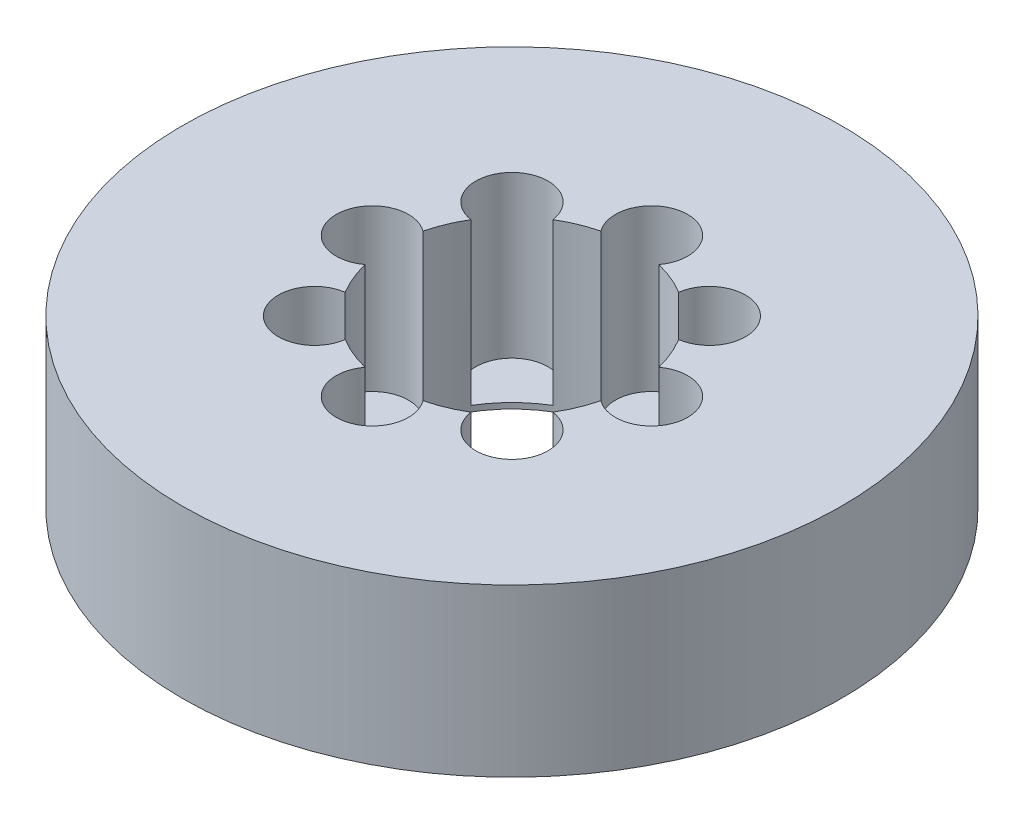
ISO-10303-21;
HEADER;
FILE_DESCRIPTION(('STEP AP214'),'2;1');
FILE_NAME('part.step','',(''),(''),'','','');
FILE_SCHEMA(('AUTOMOTIVE_DESIGN { 1 0 10303 214 1 1 1 1 }'));
ENDSEC;
DATA;
#1=APPLICATION_CONTEXT('core data for automotive mechanical design processes');
#2=APPLICATION_PROTOCOL_DEFINITION('international standard','automotive_design',2000,#1);
#3=PRODUCT_CONTEXT('',#1,'mechanical');
#4=PRODUCT('Part','Part','',(#3));
#5=PRODUCT_RELATED_PRODUCT_CATEGORY('part','',(#4));
#6=PRODUCT_DEFINITION_FORMATION('','',#4);
#7=PRODUCT_DEFINITION_CONTEXT('part definition',#1,'design');
#8=PRODUCT_DEFINITION('design','',#6,#7);
#9=PRODUCT_DEFINITION_SHAPE('','',#8);
#10=(LENGTH_UNIT() NAMED_UNIT(*) SI_UNIT(.MILLI.,.METRE.));
#11=(NAMED_UNIT(*) PLANE_ANGLE_UNIT() SI_UNIT($,.RADIAN.));
#12=(NAMED_UNIT(*) SI_UNIT($,.STERADIAN.) SOLID_ANGLE_UNIT());
#13=UNCERTAINTY_MEASURE_WITH_UNIT(LENGTH_MEASURE(1.E-05),#10,'distance_accuracy_value','');
#14=(GEOMETRIC_REPRESENTATION_CONTEXT(3) GLOBAL_UNCERTAINTY_ASSIGNED_CONTEXT((#13)) GLOBAL_UNIT_ASSIGNED_CONTEXT((#10,
#11,#12)) REPRESENTATION_CONTEXT('',''));
#15=CARTESIAN_POINT('',(0.,0.,0.));
#16=DIRECTION('',(0.,0.,1.));
#17=DIRECTION('',(1.,0.,0.));
#18=AXIS2_PLACEMENT_3D('',#15,#16,#17);
#19=CARTESIAN_POINT('',(0.,24.,0.));
#20=DIRECTION('',(0.,-1.,0.));
#21=DIRECTION('',(0.,0.,-1.));
#22=AXIS2_PLACEMENT_3D('',#19,#20,#21);
#23=CYLINDRICAL_SURFACE('',#22,47.5);
#24=CARTESIAN_POINT('',(0.,24.,0.));
#25=DIRECTION('',(0.,1.,0.));
#26=DIRECTION('',(0.,0.,1.));
#27=AXIS2_PLACEMENT_3D('',#24,#25,#26);
#28=CIRCLE('',#27,47.5);
#29=CARTESIAN_POINT('',(0.,24.,47.5));
#30=VERTEX_POINT('',#29);
#31=EDGE_CURVE('E195',#30,#30,#28,.T.);
#32=ORIENTED_EDGE('',*,*,#31,.F.);
#33=EDGE_LOOP('',(#32));
#34=FACE_BOUND('',#33,.T.);
#35=CARTESIAN_POINT('',(0.,0.,0.));
#36=DIRECTION('',(0.,1.,0.));
#37=DIRECTION('',(0.,0.,1.));
#38=AXIS2_PLACEMENT_3D('',#35,#36,#37);
#39=CIRCLE('',#38,47.5);
#40=CARTESIAN_POINT('',(0.,0.,47.5));
#41=VERTEX_POINT('',#40);
#42=EDGE_CURVE('E179',#41,#41,#39,.T.);
#43=ORIENTED_EDGE('',*,*,#42,.T.);
#44=EDGE_LOOP('',(#43));
#45=FACE_BOUND('',#44,.T.);
#46=ADVANCED_FACE('F39',(#34,#45),#23,.T.);
#47=CARTESIAN_POINT('',(0.,24.,0.));
#48=DIRECTION('',(0.,1.,0.));
#49=DIRECTION('',(0.,0.,1.));
#50=AXIS2_PLACEMENT_3D('',#47,#48,#49);
#51=PLANE('',#50);
#52=CARTESIAN_POINT('',(0.,24.,20.1182406234407));
#53=DIRECTION('',(0.,1.,0.));
#54=DIRECTION('',(1.,0.,0.));
#55=AXIS2_PLACEMENT_3D('',#52,#53,#54);
#56=CIRCLE('',#55,5.21463170952538);
#57=CARTESIAN_POINT('',(-4.17552295190512,24.,16.9945581901417));
#58=VERTEX_POINT('',#57);
#59=CARTESIAN_POINT('',(4.17552295190524,24.,16.9945581901417));
#60=VERTEX_POINT('',#59);
#61=EDGE_CURVE('E176',#58,#60,#56,.T.);
#62=ORIENTED_EDGE('',*,*,#61,.F.);
#63=CARTESIAN_POINT('',(0.,24.,0.));
#64=DIRECTION('',(0.,1.,0.));
#65=DIRECTION('',(0.,0.,1.));
#66=AXIS2_PLACEMENT_3D('',#63,#64,#65);
#67=CIRCLE('',#66,17.5);
#68=CARTESIAN_POINT('',(-9.06442674522635,24.,14.9695079338108));
#69=VERTEX_POINT('',#68);
#70=EDGE_CURVE('E166',#69,#58,#67,.T.);
#71=ORIENTED_EDGE('',*,*,#70,.F.);
#72=CARTESIAN_POINT('',(-14.2257443703776,24.,14.2257443703776));
#73=DIRECTION('',(0.,1.,0.));
#74=DIRECTION('',(0.707106781186549,0.,0.707106781186546));
#75=AXIS2_PLACEMENT_3D('',#72,#73,#74);
#76=CIRCLE('',#75,5.21463170952538);
#77=CARTESIAN_POINT('',(-14.9695079338108,24.,9.0644267452264));
#78=VERTEX_POINT('',#77);
#79=EDGE_CURVE('E147',#78,#69,#76,.T.);
#80=ORIENTED_EDGE('',*,*,#79,.F.);
#81=CARTESIAN_POINT('',(-16.9945581901417,24.,4.17552295190518));
#82=VERTEX_POINT('',#81);
#83=EDGE_CURVE('E180',#82,#78,#67,.T.);
#84=ORIENTED_EDGE('',*,*,#83,.F.);
#85=CARTESIAN_POINT('',(-20.1182406234407,24.,0.));
#86=DIRECTION('',(0.,1.,0.));
#87=DIRECTION('',(0.,0.,1.));
#88=AXIS2_PLACEMENT_3D('',#85,#86,#87);
#89=CIRCLE('',#88,5.21463170952538);
#90=CARTESIAN_POINT('',(-16.9945581901417,24.,-4.17552295190518));
#91=VERTEX_POINT('',#90);
#92=EDGE_CURVE('E186',#91,#82,#89,.T.);
#93=ORIENTED_EDGE('',*,*,#92,.F.);
#94=CARTESIAN_POINT('',(-14.9695079338109,24.,-9.06442674522619));
#95=VERTEX_POINT('',#94);
#96=EDGE_CURVE('E182',#95,#91,#67,.T.);
#97=ORIENTED_EDGE('',*,*,#96,.F.);
#98=CARTESIAN_POINT('',(-14.2257443703778,24.,-14.2257443703774));
#99=DIRECTION('',(0.,1.,0.));
#100=DIRECTION('',(-0.707106781186539,0.,0.707106781186556));
#101=AXIS2_PLACEMENT_3D('',#98,#99,#100);
#102=CIRCLE('',#101,5.21463170952538);
#103=CARTESIAN_POINT('',(-9.06442674522656,24.,-14.9695079338107));
#104=VERTEX_POINT('',#103);
#105=EDGE_CURVE('E446',#104,#95,#102,.T.);
#106=ORIENTED_EDGE('',*,*,#105,.F.);
#107=CARTESIAN_POINT('',(-4.17552295190536,24.,-16.9945581901417));
#108=VERTEX_POINT('',#107);
#109=EDGE_CURVE('E452',#108,#104,#67,.T.);
#110=ORIENTED_EDGE('',*,*,#109,.F.);
#111=CARTESIAN_POINT('',(-2.10727385121297E-13,24.,-20.1182406234407));
#112=DIRECTION('',(0.,1.,0.));
#113=DIRECTION('',(-1.,0.,0.));
#114=AXIS2_PLACEMENT_3D('',#111,#112,#113);
#115=CIRCLE('',#114,5.21463170952538);
#116=CARTESIAN_POINT('',(4.175522951905,24.,-16.9945581901418));
#117=VERTEX_POINT('',#116);
#118=EDGE_CURVE('E477',#117,#108,#115,.T.);
#119=ORIENTED_EDGE('',*,*,#118,.F.);
#120=CARTESIAN_POINT('',(9.06442674522624,24.,-14.9695079338109));
#121=VERTEX_POINT('',#120);
#122=EDGE_CURVE('E460',#121,#117,#67,.T.);
#123=ORIENTED_EDGE('',*,*,#122,.F.);
#124=CARTESIAN_POINT('',(14.2257443703775,24.,-14.2257443703777));
#125=DIRECTION('',(0.,1.,0.));
#126=DIRECTION('',(-0.707106781186554,0.,-0.707106781186541));
#127=AXIS2_PLACEMENT_3D('',#124,#125,#126);
#128=CIRCLE('',#127,5.21463170952538);
#129=CARTESIAN_POINT('',(14.9695079338107,24.,-9.0644267452265));
#130=VERTEX_POINT('',#129);
#131=EDGE_CURVE('E464',#130,#121,#128,.T.);
#132=ORIENTED_EDGE('',*,*,#131,.F.);
#133=CARTESIAN_POINT('',(16.9945581901417,24.,-4.17552295190518));
#134=VERTEX_POINT('',#133);
#135=EDGE_CURVE('E459',#134,#130,#67,.T.);
#136=ORIENTED_EDGE('',*,*,#135,.F.);
#137=CARTESIAN_POINT('',(20.1182406234407,24.,0.));
#138=DIRECTION('',(0.,1.,0.));
#139=DIRECTION('',(0.,0.,-1.));
#140=AXIS2_PLACEMENT_3D('',#137,#138,#139);
#141=CIRCLE('',#140,5.21463170952538);
#142=CARTESIAN_POINT('',(16.9945581901417,24.,4.17552295190518));
#143=VERTEX_POINT('',#142);
#144=EDGE_CURVE('E469',#143,#134,#141,.T.);
#145=ORIENTED_EDGE('',*,*,#144,.F.);
#146=CARTESIAN_POINT('',(14.9695079338109,24.,9.06442674522629));
#147=VERTEX_POINT('',#146);
#148=EDGE_CURVE('E181',#147,#143,#67,.T.);
#149=ORIENTED_EDGE('',*,*,#148,.F.);
#150=CARTESIAN_POINT('',(14.2257443703777,24.,14.2257443703775));
#151=DIRECTION('',(0.,1.,0.));
#152=DIRECTION('',(0.707106781186544,0.,-0.707106781186551));
#153=AXIS2_PLACEMENT_3D('',#150,#151,#152);
#154=CIRCLE('',#153,5.21463170952538);
#155=CARTESIAN_POINT('',(9.06442674522645,24.,14.9695079338108));
#156=VERTEX_POINT('',#155);
#157=EDGE_CURVE('E475',#156,#147,#154,.T.);
#158=ORIENTED_EDGE('',*,*,#157,.F.);
#159=EDGE_CURVE('E177',#60,#156,#67,.T.);
#160=ORIENTED_EDGE('',*,*,#159,.F.);
#161=EDGE_LOOP('',(#62,#71,#80,#84,#93,#97,#106,#110,#119,#123,#132,#136,#145,#149,#158,#160));
#162=FACE_BOUND('',#161,.T.);
#163=ORIENTED_EDGE('',*,*,#31,.T.);
#164=EDGE_LOOP('',(#163));
#165=FACE_BOUND('',#164,.T.);
#166=ADVANCED_FACE('F172',(#162,#165),#51,.T.);
#167=CARTESIAN_POINT('',(0.,0.,0.));
#168=DIRECTION('',(0.,1.,0.));
#169=DIRECTION('',(0.,0.,1.));
#170=AXIS2_PLACEMENT_3D('',#167,#168,#169);
#171=PLANE('',#170);
#172=CARTESIAN_POINT('',(0.,0.,0.));
#173=DIRECTION('',(0.,1.,0.));
#174=DIRECTION('',(0.,0.,1.));
#175=AXIS2_PLACEMENT_3D('',#172,#173,#174);
#176=CIRCLE('',#175,17.5);
#177=CARTESIAN_POINT('',(0.,0.,17.5));
#178=VERTEX_POINT('',#177);
#179=EDGE_CURVE('E187',#178,#178,#176,.T.);
#180=ORIENTED_EDGE('',*,*,#179,.T.);
#181=EDGE_LOOP('',(#180));
#182=FACE_BOUND('',#181,.T.);
#183=ORIENTED_EDGE('',*,*,#42,.F.);
#184=EDGE_LOOP('',(#183));
#185=FACE_BOUND('',#184,.T.);
#186=ADVANCED_FACE('F270',(#182,#185),#171,.F.);
#187=CARTESIAN_POINT('',(0.,24.,0.));
#188=DIRECTION('',(0.,-1.,0.));
#189=DIRECTION('',(0.,0.,-1.));
#190=AXIS2_PLACEMENT_3D('',#187,#188,#189);
#191=CYLINDRICAL_SURFACE('',#190,17.5);
#192=DIRECTION('',(0.,1.,0.));
#193=VECTOR('',#192,1.);
#194=CARTESIAN_POINT('',(-4.17552295190512,12.4083180617156,16.9945581901417));
#195=LINE('',#194,#193);
#196=CARTESIAN_POINT('',(-4.17552295190512,0.816636123431191,16.9945581901417));
#197=VERTEX_POINT('',#196);
#198=EDGE_CURVE('E11',#197,#58,#195,.T.);
#199=ORIENTED_EDGE('',*,*,#198,.F.);
#200=CARTESIAN_POINT('',(0.,0.816636123431191,0.));
#201=DIRECTION('',(0.,1.,0.));
#202=DIRECTION('',(0.,0.,1.));
#203=AXIS2_PLACEMENT_3D('',#200,#201,#202);
#204=CIRCLE('',#203,17.5);
#205=CARTESIAN_POINT('',(4.17552295190524,0.816636123431191,16.9945581901417));
#206=VERTEX_POINT('',#205);
#207=EDGE_CURVE('E250',#197,#206,#204,.T.);
#208=ORIENTED_EDGE('',*,*,#207,.T.);
#209=DIRECTION('',(0.,1.,0.));
#210=VECTOR('',#209,1.);
#211=CARTESIAN_POINT('',(4.17552295190524,12.4083180617156,16.9945581901417));
#212=LINE('',#211,#210);
#213=EDGE_CURVE('E46',#60,#206,#212,.F.);
#214=ORIENTED_EDGE('',*,*,#213,.F.);
#215=ORIENTED_EDGE('',*,*,#159,.T.);
#216=DIRECTION('',(0.,1.,0.));
#217=VECTOR('',#216,1.);
#218=CARTESIAN_POINT('',(9.06442674522645,12.4083180617156,14.9695079338108));
#219=LINE('',#218,#217);
#220=CARTESIAN_POINT('',(9.06442674522645,0.816636123431191,14.9695079338108));
#221=VERTEX_POINT('',#220);
#222=EDGE_CURVE('E244',#221,#156,#219,.T.);
#223=ORIENTED_EDGE('',*,*,#222,.F.);
#224=CARTESIAN_POINT('',(0.,0.816636123431191,0.));
#225=DIRECTION('',(0.,1.,0.));
#226=DIRECTION('',(0.,0.,1.));
#227=AXIS2_PLACEMENT_3D('',#224,#225,#226);
#228=CIRCLE('',#227,17.5);
#229=CARTESIAN_POINT('',(14.9695079338109,0.816636123431191,9.06442674522629));
#230=VERTEX_POINT('',#229);
#231=EDGE_CURVE('E238',#221,#230,#228,.T.);
#232=ORIENTED_EDGE('',*,*,#231,.T.);
#233=DIRECTION('',(0.,1.,0.));
#234=VECTOR('',#233,1.);
#235=CARTESIAN_POINT('',(14.9695079338109,12.4083180617156,9.06442674522629));
#236=LINE('',#235,#234);
#237=EDGE_CURVE('E242',#147,#230,#236,.F.);
#238=ORIENTED_EDGE('',*,*,#237,.F.);
#239=ORIENTED_EDGE('',*,*,#148,.T.);
#240=DIRECTION('',(0.,1.,0.));
#241=VECTOR('',#240,1.);
#242=CARTESIAN_POINT('',(16.9945581901417,12.4083180617156,4.17552295190518));
#243=LINE('',#242,#241);
#244=CARTESIAN_POINT('',(16.9945581901417,0.816636123431191,4.17552295190518));
#245=VERTEX_POINT('',#244);
#246=EDGE_CURVE('E236',#245,#143,#243,.T.);
#247=ORIENTED_EDGE('',*,*,#246,.F.);
#248=CARTESIAN_POINT('',(0.,0.816636123431191,0.));
#249=DIRECTION('',(0.,1.,0.));
#250=DIRECTION('',(0.,0.,1.));
#251=AXIS2_PLACEMENT_3D('',#248,#249,#250);
#252=CIRCLE('',#251,17.5);
#253=CARTESIAN_POINT('',(16.9945581901417,0.816636123431191,-4.17552295190518));
#254=VERTEX_POINT('',#253);
#255=EDGE_CURVE('E235',#245,#254,#252,.T.);
#256=ORIENTED_EDGE('',*,*,#255,.T.);
#257=DIRECTION('',(0.,1.,0.));
#258=VECTOR('',#257,1.);
#259=CARTESIAN_POINT('',(16.9945581901417,12.4083180617156,-4.17552295190518));
#260=LINE('',#259,#258);
#261=EDGE_CURVE('E234',#134,#254,#260,.F.);
#262=ORIENTED_EDGE('',*,*,#261,.F.);
#263=ORIENTED_EDGE('',*,*,#135,.T.);
#264=DIRECTION('',(0.,1.,0.));
#265=VECTOR('',#264,1.);
#266=CARTESIAN_POINT('',(14.9695079338107,12.4083180617156,-9.0644267452265));
#267=LINE('',#266,#265);
#268=CARTESIAN_POINT('',(14.9695079338107,0.816636123431191,-9.0644267452265));
#269=VERTEX_POINT('',#268);
#270=EDGE_CURVE('E229',#269,#130,#267,.T.);
#271=ORIENTED_EDGE('',*,*,#270,.F.);
#272=CARTESIAN_POINT('',(0.,0.816636123431191,0.));
#273=DIRECTION('',(0.,1.,0.));
#274=DIRECTION('',(0.,0.,1.));
#275=AXIS2_PLACEMENT_3D('',#272,#273,#274);
#276=CIRCLE('',#275,17.5);
#277=CARTESIAN_POINT('',(9.06442674522624,0.816636123431191,-14.9695079338109));
#278=VERTEX_POINT('',#277);
#279=EDGE_CURVE('E221',#269,#278,#276,.T.);
#280=ORIENTED_EDGE('',*,*,#279,.T.);
#281=DIRECTION('',(0.,1.,0.));
#282=VECTOR('',#281,1.);
#283=CARTESIAN_POINT('',(9.06442674522624,12.4083180617156,-14.9695079338109));
#284=LINE('',#283,#282);
#285=EDGE_CURVE('E230',#121,#278,#284,.F.);
#286=ORIENTED_EDGE('',*,*,#285,.F.);
#287=ORIENTED_EDGE('',*,*,#122,.T.);
#288=DIRECTION('',(0.,1.,0.));
#289=VECTOR('',#288,1.);
#290=CARTESIAN_POINT('',(4.175522951905,12.4083180617156,-16.9945581901418));
#291=LINE('',#290,#289);
#292=CARTESIAN_POINT('',(4.175522951905,0.816636123431191,-16.9945581901418));
#293=VERTEX_POINT('',#292);
#294=EDGE_CURVE('E225',#293,#117,#291,.T.);
#295=ORIENTED_EDGE('',*,*,#294,.F.);
#296=CARTESIAN_POINT('',(0.,0.816636123431191,0.));
#297=DIRECTION('',(0.,1.,0.));
#298=DIRECTION('',(0.,0.,1.));
#299=AXIS2_PLACEMENT_3D('',#296,#297,#298);
#300=CIRCLE('',#299,17.5);
#301=CARTESIAN_POINT('',(-4.17552295190536,0.816636123431191,-16.9945581901417));
#302=VERTEX_POINT('',#301);
#303=EDGE_CURVE('E216',#293,#302,#300,.T.);
#304=ORIENTED_EDGE('',*,*,#303,.T.);
#305=DIRECTION('',(0.,1.,0.));
#306=VECTOR('',#305,1.);
#307=CARTESIAN_POINT('',(-4.17552295190536,12.4083180617156,-16.9945581901417));
#308=LINE('',#307,#306);
#309=EDGE_CURVE('E218',#108,#302,#308,.F.);
#310=ORIENTED_EDGE('',*,*,#309,.F.);
#311=ORIENTED_EDGE('',*,*,#109,.T.);
#312=DIRECTION('',(0.,1.,0.));
#313=VECTOR('',#312,1.);
#314=CARTESIAN_POINT('',(-9.06442674522656,12.4083180617156,-14.9695079338107));
#315=LINE('',#314,#313);
#316=CARTESIAN_POINT('',(-9.06442674522656,0.816636123431191,-14.9695079338107));
#317=VERTEX_POINT('',#316);
#318=EDGE_CURVE('E212',#317,#104,#315,.T.);
#319=ORIENTED_EDGE('',*,*,#318,.F.);
#320=CARTESIAN_POINT('',(0.,0.816636123431191,0.));
#321=DIRECTION('',(0.,1.,0.));
#322=DIRECTION('',(0.,0.,1.));
#323=AXIS2_PLACEMENT_3D('',#320,#321,#322);
#324=CIRCLE('',#323,17.5);
#325=CARTESIAN_POINT('',(-14.9695079338109,0.816636123431191,-9.06442674522619));
#326=VERTEX_POINT('',#325);
#327=EDGE_CURVE('E208',#317,#326,#324,.T.);
#328=ORIENTED_EDGE('',*,*,#327,.T.);
#329=DIRECTION('',(0.,1.,0.));
#330=VECTOR('',#329,1.);
#331=CARTESIAN_POINT('',(-14.9695079338109,12.4083180617156,-9.06442674522619));
#332=LINE('',#331,#330);
#333=EDGE_CURVE('E211',#95,#326,#332,.F.);
#334=ORIENTED_EDGE('',*,*,#333,.F.);
#335=ORIENTED_EDGE('',*,*,#96,.T.);
#336=DIRECTION('',(0.,1.,0.));
#337=VECTOR('',#336,1.);
#338=CARTESIAN_POINT('',(-16.9945581901417,12.4083180617156,-4.17552295190518));
#339=LINE('',#338,#337);
#340=CARTESIAN_POINT('',(-16.9945581901417,0.816636123431191,-4.17552295190518));
#341=VERTEX_POINT('',#340);
#342=EDGE_CURVE('E201',#341,#91,#339,.T.);
#343=ORIENTED_EDGE('',*,*,#342,.F.);
#344=CARTESIAN_POINT('',(0.,0.816636123431191,0.));
#345=DIRECTION('',(0.,1.,0.));
#346=DIRECTION('',(0.,0.,1.));
#347=AXIS2_PLACEMENT_3D('',#344,#345,#346);
#348=CIRCLE('',#347,17.5);
#349=CARTESIAN_POINT('',(-16.9945581901417,0.816636123431191,4.17552295190518));
#350=VERTEX_POINT('',#349);
#351=EDGE_CURVE('E194',#341,#350,#348,.T.);
#352=ORIENTED_EDGE('',*,*,#351,.T.);
#353=DIRECTION('',(0.,1.,0.));
#354=VECTOR('',#353,1.);
#355=CARTESIAN_POINT('',(-16.9945581901417,12.4083180617156,4.17552295190518));
#356=LINE('',#355,#354);
#357=EDGE_CURVE('E199',#82,#350,#356,.F.);
#358=ORIENTED_EDGE('',*,*,#357,.F.);
#359=ORIENTED_EDGE('',*,*,#83,.T.);
#360=DIRECTION('',(0.,1.,0.));
#361=VECTOR('',#360,1.);
#362=CARTESIAN_POINT('',(-14.9695079338108,12.4083180617156,9.0644267452264));
#363=LINE('',#362,#361);
#364=CARTESIAN_POINT('',(-14.9695079338108,0.816636123431191,9.0644267452264));
#365=VERTEX_POINT('',#364);
#366=EDGE_CURVE('E160',#365,#78,#363,.T.);
#367=ORIENTED_EDGE('',*,*,#366,.F.);
#368=CARTESIAN_POINT('',(0.,0.816636123431191,0.));
#369=DIRECTION('',(0.,1.,0.));
#370=DIRECTION('',(0.,0.,1.));
#371=AXIS2_PLACEMENT_3D('',#368,#369,#370);
#372=CIRCLE('',#371,17.5);
#373=CARTESIAN_POINT('',(-9.06442674522635,0.816636123431191,14.9695079338108));
#374=VERTEX_POINT('',#373);
#375=EDGE_CURVE('E168',#365,#374,#372,.T.);
#376=ORIENTED_EDGE('',*,*,#375,.T.);
#377=DIRECTION('',(0.,1.,0.));
#378=VECTOR('',#377,1.);
#379=CARTESIAN_POINT('',(-9.06442674522635,12.4083180617156,14.9695079338108));
#380=LINE('',#379,#378);
#381=EDGE_CURVE('E152',#69,#374,#380,.F.);
#382=ORIENTED_EDGE('',*,*,#381,.F.);
#383=ORIENTED_EDGE('',*,*,#70,.T.);
#384=EDGE_LOOP('',(#199,#208,#214,#215,#223,#232,#238,#239,#247,#256,#262,#263,#271,#280,#286,
#287,#295,#304,#310,#311,#319,#328,#334,#335,#343,#352,#358,#359,#367,#376,#382,#383));
#385=FACE_BOUND('',#384,.T.);
#386=ORIENTED_EDGE('',*,*,#179,.F.);
#387=EDGE_LOOP('',(#386));
#388=FACE_BOUND('',#387,.T.);
#389=ADVANCED_FACE('F170',(#385,#388),#191,.F.);
#390=CARTESIAN_POINT('',(-20.1182406234407,0.816636123431191,0.));
#391=DIRECTION('',(0.,1.,0.));
#392=DIRECTION('',(0.,0.,1.));
#393=AXIS2_PLACEMENT_3D('',#390,#391,#392);
#394=CYLINDRICAL_SURFACE('',#393,5.21463170952538);
#395=ORIENTED_EDGE('',*,*,#342,.T.);
#396=ORIENTED_EDGE('',*,*,#92,.T.);
#397=ORIENTED_EDGE('',*,*,#357,.T.);
#398=CARTESIAN_POINT('',(-20.1182406234407,0.816636123431191,0.));
#399=DIRECTION('',(0.,1.,0.));
#400=DIRECTION('',(0.,0.,1.));
#401=AXIS2_PLACEMENT_3D('',#398,#399,#400);
#402=CIRCLE('',#401,5.21463170952538);
#403=EDGE_CURVE('E191',#341,#350,#402,.T.);
#404=ORIENTED_EDGE('',*,*,#403,.F.);
#405=EDGE_LOOP('',(#395,#396,#397,#404));
#406=FACE_BOUND('',#405,.T.);
#407=ADVANCED_FACE('F279',(#406),#394,.F.);
#408=CARTESIAN_POINT('',(-20.1182406234407,0.816636123431191,0.));
#409=DIRECTION('',(0.,1.,0.));
#410=DIRECTION('',(0.,0.,1.));
#411=AXIS2_PLACEMENT_3D('',#408,#409,#410);
#412=PLANE('',#411);
#413=ORIENTED_EDGE('',*,*,#403,.T.);
#414=ORIENTED_EDGE('',*,*,#351,.F.);
#415=EDGE_LOOP('',(#413,#414));
#416=FACE_BOUND('',#415,.T.);
#417=ADVANCED_FACE('F285',(#416),#412,.T.);
#418=CARTESIAN_POINT('',(-14.2257443703776,0.816636123431191,14.2257443703776));
#419=DIRECTION('',(0.,1.,0.));
#420=DIRECTION('',(0.,0.,1.));
#421=AXIS2_PLACEMENT_3D('',#418,#419,#420);
#422=CYLINDRICAL_SURFACE('',#421,5.21463170952538);
#423=ORIENTED_EDGE('',*,*,#366,.T.);
#424=ORIENTED_EDGE('',*,*,#79,.T.);
#425=ORIENTED_EDGE('',*,*,#381,.T.);
#426=CARTESIAN_POINT('',(-14.2257443703776,0.816636123431191,14.2257443703776));
#427=DIRECTION('',(0.,1.,0.));
#428=DIRECTION('',(0.707106781186549,0.,0.707106781186546));
#429=AXIS2_PLACEMENT_3D('',#426,#427,#428);
#430=CIRCLE('',#429,5.21463170952538);
#431=EDGE_CURVE('E165',#365,#374,#430,.T.);
#432=ORIENTED_EDGE('',*,*,#431,.F.);
#433=EDGE_LOOP('',(#423,#424,#425,#432));
#434=FACE_BOUND('',#433,.T.);
#435=ADVANCED_FACE('F155',(#434),#422,.F.);
#436=CARTESIAN_POINT('',(-14.2257443703776,0.816636123431191,14.2257443703776));
#437=DIRECTION('',(0.,1.,0.));
#438=DIRECTION('',(0.707106781186549,0.,0.707106781186546));
#439=AXIS2_PLACEMENT_3D('',#436,#437,#438);
#440=PLANE('',#439);
#441=ORIENTED_EDGE('',*,*,#431,.T.);
#442=ORIENTED_EDGE('',*,*,#375,.F.);
#443=EDGE_LOOP('',(#441,#442));
#444=FACE_BOUND('',#443,.T.);
#445=ADVANCED_FACE('F288',(#444),#440,.T.);
#446=CARTESIAN_POINT('',(-14.2257443703778,0.816636123431191,-14.2257443703774));
#447=DIRECTION('',(0.,1.,0.));
#448=DIRECTION('',(0.,0.,1.));
#449=AXIS2_PLACEMENT_3D('',#446,#447,#448);
#450=CYLINDRICAL_SURFACE('',#449,5.21463170952538);
#451=ORIENTED_EDGE('',*,*,#318,.T.);
#452=ORIENTED_EDGE('',*,*,#105,.T.);
#453=ORIENTED_EDGE('',*,*,#333,.T.);
#454=CARTESIAN_POINT('',(-14.2257443703778,0.816636123431191,-14.2257443703774));
#455=DIRECTION('',(0.,1.,0.));
#456=DIRECTION('',(-0.707106781186539,0.,0.707106781186556));
#457=AXIS2_PLACEMENT_3D('',#454,#455,#456);
#458=CIRCLE('',#457,5.21463170952538);
#459=EDGE_CURVE('E447',#317,#326,#458,.T.);
#460=ORIENTED_EDGE('',*,*,#459,.F.);
#461=EDGE_LOOP('',(#451,#452,#453,#460));
#462=FACE_BOUND('',#461,.T.);
#463=ADVANCED_FACE('F295',(#462),#450,.F.);
#464=CARTESIAN_POINT('',(-14.2257443703778,0.816636123431191,-14.2257443703774));
#465=DIRECTION('',(0.,1.,0.));
#466=DIRECTION('',(-0.707106781186539,0.,0.707106781186556));
#467=AXIS2_PLACEMENT_3D('',#464,#465,#466);
#468=PLANE('',#467);
#469=ORIENTED_EDGE('',*,*,#459,.T.);
#470=ORIENTED_EDGE('',*,*,#327,.F.);
#471=EDGE_LOOP('',(#469,#470));
#472=FACE_BOUND('',#471,.T.);
#473=ADVANCED_FACE('F375',(#472),#468,.T.);
#474=CARTESIAN_POINT('',(-2.10727385121297E-13,0.816636123431191,-20.1182406234407));
#475=DIRECTION('',(0.,1.,0.));
#476=DIRECTION('',(0.,0.,1.));
#477=AXIS2_PLACEMENT_3D('',#474,#475,#476);
#478=CYLINDRICAL_SURFACE('',#477,5.21463170952538);
#479=ORIENTED_EDGE('',*,*,#294,.T.);
#480=ORIENTED_EDGE('',*,*,#118,.T.);
#481=ORIENTED_EDGE('',*,*,#309,.T.);
#482=CARTESIAN_POINT('',(-2.10727385121297E-13,0.816636123431191,-20.1182406234407));
#483=DIRECTION('',(0.,1.,0.));
#484=DIRECTION('',(-1.,0.,0.));
#485=AXIS2_PLACEMENT_3D('',#482,#483,#484);
#486=CIRCLE('',#485,5.21463170952538);
#487=EDGE_CURVE('E467',#293,#302,#486,.T.);
#488=ORIENTED_EDGE('',*,*,#487,.F.);
#489=EDGE_LOOP('',(#479,#480,#481,#488));
#490=FACE_BOUND('',#489,.T.);
#491=ADVANCED_FACE('F361',(#490),#478,.F.);
#492=CARTESIAN_POINT('',(-2.10727385121297E-13,0.816636123431191,-20.1182406234407));
#493=DIRECTION('',(0.,1.,0.));
#494=DIRECTION('',(-1.,0.,0.));
#495=AXIS2_PLACEMENT_3D('',#492,#493,#494);
#496=PLANE('',#495);
#497=ORIENTED_EDGE('',*,*,#487,.T.);
#498=ORIENTED_EDGE('',*,*,#303,.F.);
#499=EDGE_LOOP('',(#497,#498));
#500=FACE_BOUND('',#499,.T.);
#501=ADVANCED_FACE('F297',(#500),#496,.T.);
#502=CARTESIAN_POINT('',(14.2257443703775,0.816636123431191,-14.2257443703777));
#503=DIRECTION('',(0.,1.,0.));
#504=DIRECTION('',(0.,0.,1.));
#505=AXIS2_PLACEMENT_3D('',#502,#503,#504);
#506=CYLINDRICAL_SURFACE('',#505,5.21463170952538);
#507=ORIENTED_EDGE('',*,*,#270,.T.);
#508=ORIENTED_EDGE('',*,*,#131,.T.);
#509=ORIENTED_EDGE('',*,*,#285,.T.);
#510=CARTESIAN_POINT('',(14.2257443703775,0.816636123431191,-14.2257443703777));
#511=DIRECTION('',(0.,1.,0.));
#512=DIRECTION('',(-0.707106781186554,0.,-0.707106781186541));
#513=AXIS2_PLACEMENT_3D('',#510,#511,#512);
#514=CIRCLE('',#513,5.21463170952538);
#515=EDGE_CURVE('E470',#269,#278,#514,.T.);
#516=ORIENTED_EDGE('',*,*,#515,.F.);
#517=EDGE_LOOP('',(#507,#508,#509,#516));
#518=FACE_BOUND('',#517,.T.);
#519=ADVANCED_FACE('F294',(#518),#506,.F.);
#520=CARTESIAN_POINT('',(14.2257443703775,0.816636123431191,-14.2257443703777));
#521=DIRECTION('',(0.,1.,0.));
#522=DIRECTION('',(-0.707106781186554,0.,-0.707106781186541));
#523=AXIS2_PLACEMENT_3D('',#520,#521,#522);
#524=PLANE('',#523);
#525=ORIENTED_EDGE('',*,*,#515,.T.);
#526=ORIENTED_EDGE('',*,*,#279,.F.);
#527=EDGE_LOOP('',(#525,#526));
#528=FACE_BOUND('',#527,.T.);
#529=ADVANCED_FACE('F300',(#528),#524,.T.);
#530=CARTESIAN_POINT('',(20.1182406234407,0.816636123431191,0.));
#531=DIRECTION('',(0.,1.,0.));
#532=DIRECTION('',(0.,0.,1.));
#533=AXIS2_PLACEMENT_3D('',#530,#531,#532);
#534=CYLINDRICAL_SURFACE('',#533,5.21463170952538);
#535=ORIENTED_EDGE('',*,*,#246,.T.);
#536=ORIENTED_EDGE('',*,*,#144,.T.);
#537=ORIENTED_EDGE('',*,*,#261,.T.);
#538=CARTESIAN_POINT('',(20.1182406234407,0.816636123431191,0.));
#539=DIRECTION('',(0.,1.,0.));
#540=DIRECTION('',(0.,0.,-1.));
#541=AXIS2_PLACEMENT_3D('',#538,#539,#540);
#542=CIRCLE('',#541,5.21463170952538);
#543=EDGE_CURVE('E472',#245,#254,#542,.T.);
#544=ORIENTED_EDGE('',*,*,#543,.F.);
#545=EDGE_LOOP('',(#535,#536,#537,#544));
#546=FACE_BOUND('',#545,.T.);
#547=ADVANCED_FACE('F305',(#546),#534,.F.);
#548=CARTESIAN_POINT('',(20.1182406234407,0.816636123431191,0.));
#549=DIRECTION('',(0.,1.,0.));
#550=DIRECTION('',(0.,0.,-1.));
#551=AXIS2_PLACEMENT_3D('',#548,#549,#550);
#552=PLANE('',#551);
#553=ORIENTED_EDGE('',*,*,#543,.T.);
#554=ORIENTED_EDGE('',*,*,#255,.F.);
#555=EDGE_LOOP('',(#553,#554));
#556=FACE_BOUND('',#555,.T.);
#557=ADVANCED_FACE('F308',(#556),#552,.T.);
#558=CARTESIAN_POINT('',(14.2257443703777,0.816636123431191,14.2257443703775));
#559=DIRECTION('',(0.,1.,0.));
#560=DIRECTION('',(0.,0.,1.));
#561=AXIS2_PLACEMENT_3D('',#558,#559,#560);
#562=CYLINDRICAL_SURFACE('',#561,5.21463170952538);
#563=ORIENTED_EDGE('',*,*,#222,.T.);
#564=ORIENTED_EDGE('',*,*,#157,.T.);
#565=ORIENTED_EDGE('',*,*,#237,.T.);
#566=CARTESIAN_POINT('',(14.2257443703777,0.816636123431191,14.2257443703775));
#567=DIRECTION('',(0.,1.,0.));
#568=DIRECTION('',(0.707106781186544,0.,-0.707106781186551));
#569=AXIS2_PLACEMENT_3D('',#566,#567,#568);
#570=CIRCLE('',#569,5.21463170952538);
#571=EDGE_CURVE('E56',#221,#230,#570,.T.);
#572=ORIENTED_EDGE('',*,*,#571,.F.);
#573=EDGE_LOOP('',(#563,#564,#565,#572));
#574=FACE_BOUND('',#573,.T.);
#575=ADVANCED_FACE('F309',(#574),#562,.F.);
#576=CARTESIAN_POINT('',(14.2257443703777,0.816636123431191,14.2257443703775));
#577=DIRECTION('',(0.,1.,0.));
#578=DIRECTION('',(0.707106781186544,0.,-0.707106781186551));
#579=AXIS2_PLACEMENT_3D('',#576,#577,#578);
#580=PLANE('',#579);
#581=ORIENTED_EDGE('',*,*,#571,.T.);
#582=ORIENTED_EDGE('',*,*,#231,.F.);
#583=EDGE_LOOP('',(#581,#582));
#584=FACE_BOUND('',#583,.T.);
#585=ADVANCED_FACE('F256',(#584),#580,.T.);
#586=CARTESIAN_POINT('',(0.,0.816636123431191,20.1182406234407));
#587=DIRECTION('',(0.,1.,0.));
#588=DIRECTION('',(0.,0.,1.));
#589=AXIS2_PLACEMENT_3D('',#586,#587,#588);
#590=CYLINDRICAL_SURFACE('',#589,5.21463170952538);
#591=ORIENTED_EDGE('',*,*,#198,.T.);
#592=ORIENTED_EDGE('',*,*,#61,.T.);
#593=ORIENTED_EDGE('',*,*,#213,.T.);
#594=CARTESIAN_POINT('',(0.,0.816636123431191,20.1182406234407));
#595=DIRECTION('',(0.,1.,0.));
#596=DIRECTION('',(1.,0.,0.));
#597=AXIS2_PLACEMENT_3D('',#594,#595,#596);
#598=CIRCLE('',#597,5.21463170952538);
#599=EDGE_CURVE('E55',#197,#206,#598,.T.);
#600=ORIENTED_EDGE('',*,*,#599,.F.);
#601=EDGE_LOOP('',(#591,#592,#593,#600));
#602=FACE_BOUND('',#601,.T.);
#603=ADVANCED_FACE('F253',(#602),#590,.F.);
#604=CARTESIAN_POINT('',(0.,0.816636123431191,20.1182406234407));
#605=DIRECTION('',(0.,1.,0.));
#606=DIRECTION('',(1.,0.,0.));
#607=AXIS2_PLACEMENT_3D('',#604,#605,#606);
#608=PLANE('',#607);
#609=ORIENTED_EDGE('',*,*,#599,.T.);
#610=ORIENTED_EDGE('',*,*,#207,.F.);
#611=EDGE_LOOP('',(#609,#610));
#612=FACE_BOUND('',#611,.T.);
#613=ADVANCED_FACE('F252',(#612),#608,.T.);
#614=CLOSED_SHELL('',(#46,#166,#186,#389,#407,#417,#435,#445,#463,#473,#491,#501,#519,#529,#547,
#557,#575,#585,#603,#613));
#615=MANIFOLD_SOLID_BREP('B2',#614);
#616=ADVANCED_BREP_SHAPE_REPRESENTATION('',(#18,#615),#14);
#617=SHAPE_DEFINITION_REPRESENTATION(#9,#616);
ENDSEC;
END-ISO-10303-21;
